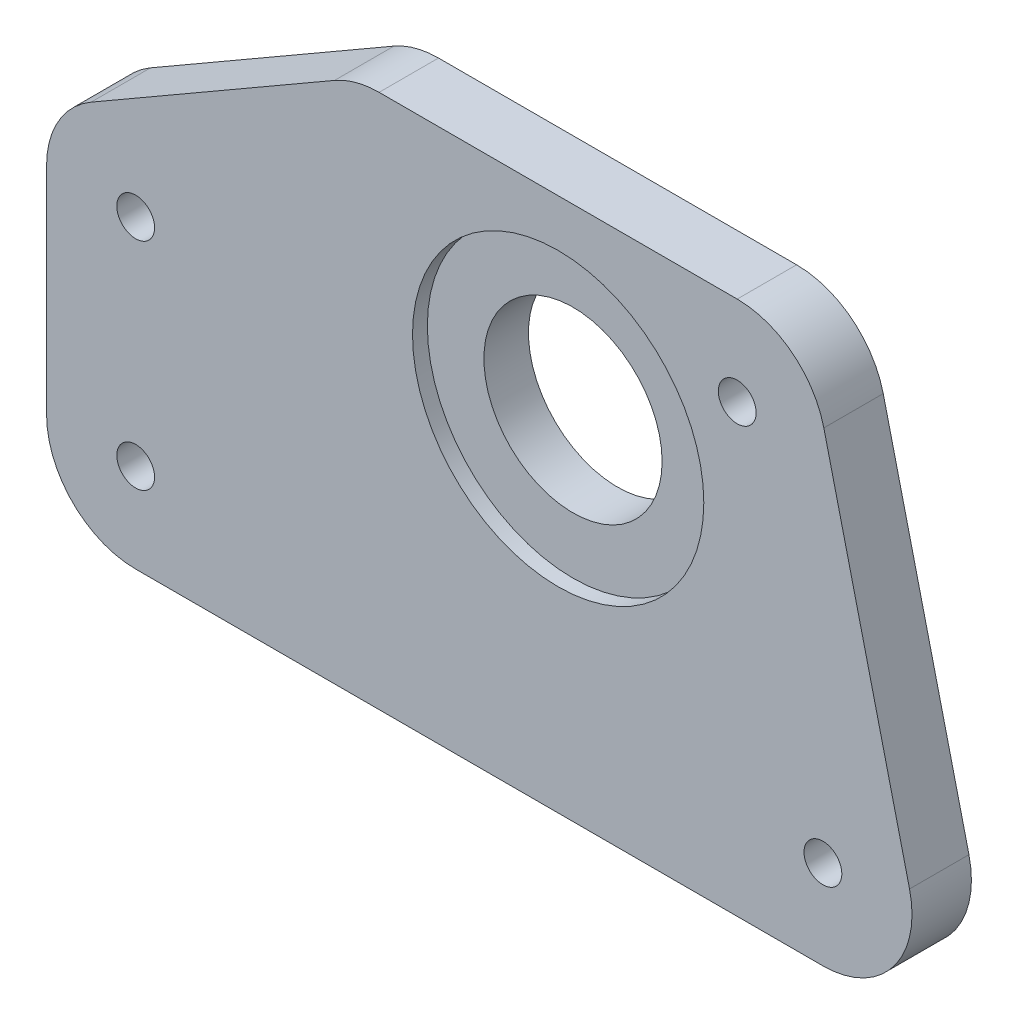
ISO-10303-21;
HEADER;
FILE_DESCRIPTION(('STEP AP214'),'2;1');
FILE_NAME('part.step','',(''),(''),'','','');
FILE_SCHEMA(('AUTOMOTIVE_DESIGN { 1 0 10303 214 1 1 1 1 }'));
ENDSEC;
DATA;
#1=APPLICATION_CONTEXT('core data for automotive mechanical design processes');
#2=APPLICATION_PROTOCOL_DEFINITION('international standard','automotive_design',2000,#1);
#3=PRODUCT_CONTEXT('',#1,'mechanical');
#4=PRODUCT('Part','Part','',(#3));
#5=PRODUCT_RELATED_PRODUCT_CATEGORY('part','',(#4));
#6=PRODUCT_DEFINITION_FORMATION('','',#4);
#7=PRODUCT_DEFINITION_CONTEXT('part definition',#1,'design');
#8=PRODUCT_DEFINITION('design','',#6,#7);
#9=PRODUCT_DEFINITION_SHAPE('','',#8);
#10=(LENGTH_UNIT() NAMED_UNIT(*) SI_UNIT(.MILLI.,.METRE.));
#11=(NAMED_UNIT(*) PLANE_ANGLE_UNIT() SI_UNIT($,.RADIAN.));
#12=(NAMED_UNIT(*) SI_UNIT($,.STERADIAN.) SOLID_ANGLE_UNIT());
#13=UNCERTAINTY_MEASURE_WITH_UNIT(LENGTH_MEASURE(1.E-05),#10,'distance_accuracy_value','');
#14=(GEOMETRIC_REPRESENTATION_CONTEXT(3) GLOBAL_UNCERTAINTY_ASSIGNED_CONTEXT((#13)) GLOBAL_UNIT_ASSIGNED_CONTEXT((#10,
#11,#12)) REPRESENTATION_CONTEXT('',''));
#15=CARTESIAN_POINT('',(0.,0.,0.));
#16=DIRECTION('',(0.,0.,1.));
#17=DIRECTION('',(1.,0.,0.));
#18=AXIS2_PLACEMENT_3D('',#15,#16,#17);
#19=CARTESIAN_POINT('',(0.,0.,6.35));
#20=DIRECTION('',(0.,0.,-1.));
#21=DIRECTION('',(-1.,0.,0.));
#22=AXIS2_PLACEMENT_3D('',#19,#20,#21);
#23=CYLINDRICAL_SURFACE('',#22,9.525);
#24=CARTESIAN_POINT('',(0.,0.,0.));
#25=DIRECTION('',(0.,0.,1.));
#26=DIRECTION('',(1.,0.,0.));
#27=AXIS2_PLACEMENT_3D('',#24,#25,#26);
#28=CIRCLE('',#27,9.525);
#29=CARTESIAN_POINT('',(9.525,0.,0.));
#30=VERTEX_POINT('',#29);
#31=EDGE_CURVE('E143',#30,#30,#28,.T.);
#32=ORIENTED_EDGE('',*,*,#31,.F.);
#33=EDGE_LOOP('',(#32));
#34=FACE_BOUND('',#33,.T.);
#35=CARTESIAN_POINT('',(0.,0.,4.7625));
#36=DIRECTION('',(0.,0.,1.));
#37=DIRECTION('',(1.,0.,0.));
#38=AXIS2_PLACEMENT_3D('',#35,#36,#37);
#39=CIRCLE('',#38,9.525);
#40=CARTESIAN_POINT('',(9.525,0.,4.7625));
#41=VERTEX_POINT('',#40);
#42=EDGE_CURVE('E36',#41,#41,#39,.T.);
#43=ORIENTED_EDGE('',*,*,#42,.T.);
#44=EDGE_LOOP('',(#43));
#45=FACE_BOUND('',#44,.T.);
#46=ADVANCED_FACE('F33',(#34,#45),#23,.F.);
#47=CARTESIAN_POINT('',(0.,-36.5125,6.35));
#48=DIRECTION('',(0.,1.,0.));
#49=DIRECTION('',(0.,0.,1.));
#50=AXIS2_PLACEMENT_3D('',#47,#48,#49);
#51=PLANE('',#50);
#52=DIRECTION('',(1.,0.,0.));
#53=VECTOR('',#52,1.);
#54=CARTESIAN_POINT('',(0.,-36.5125,0.));
#55=LINE('',#54,#53);
#56=CARTESIAN_POINT('',(-45.1626171174491,-36.5125,0.));
#57=VERTEX_POINT('',#56);
#58=CARTESIAN_POINT('',(28.303378868006,-36.5125,0.));
#59=VERTEX_POINT('',#58);
#60=EDGE_CURVE('E146',#57,#59,#55,.T.);
#61=ORIENTED_EDGE('',*,*,#60,.T.);
#62=DIRECTION('',(0.,0.,-1.));
#63=VECTOR('',#62,1.);
#64=CARTESIAN_POINT('',(28.303378868006,-36.5125,6.35));
#65=LINE('',#64,#63);
#66=CARTESIAN_POINT('',(28.303378868006,-36.5125,6.35));
#67=VERTEX_POINT('',#66);
#68=EDGE_CURVE('E11',#67,#59,#65,.T.);
#69=ORIENTED_EDGE('',*,*,#68,.F.);
#70=DIRECTION('',(1.,0.,0.));
#71=VECTOR('',#70,1.);
#72=CARTESIAN_POINT('',(0.,-36.5125,6.35));
#73=LINE('',#72,#71);
#74=CARTESIAN_POINT('',(-45.1626171174491,-36.5125,6.35));
#75=VERTEX_POINT('',#74);
#76=EDGE_CURVE('E170',#75,#67,#73,.T.);
#77=ORIENTED_EDGE('',*,*,#76,.F.);
#78=DIRECTION('',(0.,0.,-1.));
#79=VECTOR('',#78,1.);
#80=CARTESIAN_POINT('',(-45.1626171174491,-36.5125,6.35));
#81=LINE('',#80,#79);
#82=EDGE_CURVE('E142',#75,#57,#81,.T.);
#83=ORIENTED_EDGE('',*,*,#82,.T.);
#84=EDGE_LOOP('',(#61,#69,#77,#83));
#85=FACE_BOUND('',#84,.T.);
#86=ADVANCED_FACE('F217',(#85),#51,.F.);
#87=CARTESIAN_POINT('',(28.303378868006,-26.9875,6.35));
#88=DIRECTION('',(0.,0.,-1.));
#89=DIRECTION('',(-1.,0.,0.));
#90=AXIS2_PLACEMENT_3D('',#87,#88,#89);
#91=CYLINDRICAL_SURFACE('',#90,9.52499999999998);
#92=CARTESIAN_POINT('',(28.303378868006,-26.9875,0.));
#93=DIRECTION('',(0.,0.,1.));
#94=DIRECTION('',(1.,0.,0.));
#95=AXIS2_PLACEMENT_3D('',#92,#93,#94);
#96=CIRCLE('',#95,9.52499999999998);
#97=CARTESIAN_POINT('',(37.5642887039194,-24.760130697194,0.));
#98=VERTEX_POINT('',#97);
#99=EDGE_CURVE('E149',#59,#98,#96,.T.);
#100=ORIENTED_EDGE('',*,*,#99,.T.);
#101=DIRECTION('',(0.,0.,-1.));
#102=VECTOR('',#101,1.);
#103=CARTESIAN_POINT('',(37.5642887039194,-24.760130697194,6.35));
#104=LINE('',#103,#102);
#105=CARTESIAN_POINT('',(37.5642887039194,-24.760130697194,6.35));
#106=VERTEX_POINT('',#105);
#107=EDGE_CURVE('E42',#106,#98,#104,.T.);
#108=ORIENTED_EDGE('',*,*,#107,.F.);
#109=CARTESIAN_POINT('',(28.303378868006,-26.9875,6.35));
#110=DIRECTION('',(0.,0.,1.));
#111=DIRECTION('',(1.,0.,0.));
#112=AXIS2_PLACEMENT_3D('',#109,#110,#111);
#113=CIRCLE('',#112,9.52499999999998);
#114=EDGE_CURVE('E98',#67,#106,#113,.T.);
#115=ORIENTED_EDGE('',*,*,#114,.F.);
#116=ORIENTED_EDGE('',*,*,#68,.T.);
#117=EDGE_LOOP('',(#100,#108,#115,#116));
#118=FACE_BOUND('',#117,.T.);
#119=ADVANCED_FACE('F188',(#118),#91,.T.);
#120=CARTESIAN_POINT('',(29.8806631127974,7.18668823519191,6.35));
#121=DIRECTION('',(0.972273998521092,0.233844546226349,0.));
#122=DIRECTION('',(-0.233844546226349,0.972273998521092,0.));
#123=AXIS2_PLACEMENT_3D('',#120,#121,#122);
#124=PLANE('',#123);
#125=DIRECTION('',(0.233844546226349,-0.972273998521092,0.));
#126=VECTOR('',#125,1.);
#127=CARTESIAN_POINT('',(29.8806631127974,7.18668823519191,0.));
#128=LINE('',#127,#126);
#129=CARTESIAN_POINT('',(28.400743011269,13.339869302806,0.));
#130=VERTEX_POINT('',#129);
#131=EDGE_CURVE('E152',#130,#98,#128,.T.);
#132=ORIENTED_EDGE('',*,*,#131,.F.);
#133=DIRECTION('',(0.,0.,-1.));
#134=VECTOR('',#133,1.);
#135=CARTESIAN_POINT('',(28.400743011269,13.339869302806,6.35));
#136=LINE('',#135,#134);
#137=CARTESIAN_POINT('',(28.400743011269,13.339869302806,6.35));
#138=VERTEX_POINT('',#137);
#139=EDGE_CURVE('E180',#138,#130,#136,.T.);
#140=ORIENTED_EDGE('',*,*,#139,.F.);
#141=DIRECTION('',(0.233844546226349,-0.972273998521092,0.));
#142=VECTOR('',#141,1.);
#143=CARTESIAN_POINT('',(29.8806631127974,7.18668823519191,6.35));
#144=LINE('',#143,#142);
#145=EDGE_CURVE('E187',#138,#106,#144,.T.);
#146=ORIENTED_EDGE('',*,*,#145,.T.);
#147=ORIENTED_EDGE('',*,*,#107,.T.);
#148=EDGE_LOOP('',(#132,#140,#146,#147));
#149=FACE_BOUND('',#148,.T.);
#150=ADVANCED_FACE('F185',(#149),#124,.T.);
#151=CARTESIAN_POINT('',(19.1398331753556,11.1125,6.35));
#152=DIRECTION('',(0.,0.,-1.));
#153=DIRECTION('',(-1.,0.,0.));
#154=AXIS2_PLACEMENT_3D('',#151,#152,#153);
#155=CYLINDRICAL_SURFACE('',#154,9.525);
#156=CARTESIAN_POINT('',(19.1398331753556,11.1125,0.));
#157=DIRECTION('',(0.,0.,1.));
#158=DIRECTION('',(1.,0.,0.));
#159=AXIS2_PLACEMENT_3D('',#156,#157,#158);
#160=CIRCLE('',#159,9.525);
#161=CARTESIAN_POINT('',(19.1398331753556,20.6375,0.));
#162=VERTEX_POINT('',#161);
#163=EDGE_CURVE('E155',#130,#162,#160,.T.);
#164=ORIENTED_EDGE('',*,*,#163,.T.);
#165=DIRECTION('',(0.,0.,-1.));
#166=VECTOR('',#165,1.);
#167=CARTESIAN_POINT('',(19.1398331753556,20.6375,6.35));
#168=LINE('',#167,#166);
#169=CARTESIAN_POINT('',(19.1398331753556,20.6375,6.35));
#170=VERTEX_POINT('',#169);
#171=EDGE_CURVE('E178',#170,#162,#168,.T.);
#172=ORIENTED_EDGE('',*,*,#171,.F.);
#173=CARTESIAN_POINT('',(19.1398331753556,11.1125,6.35));
#174=DIRECTION('',(0.,0.,1.));
#175=DIRECTION('',(1.,0.,0.));
#176=AXIS2_PLACEMENT_3D('',#173,#174,#175);
#177=CIRCLE('',#176,9.525);
#178=EDGE_CURVE('E201',#138,#170,#177,.T.);
#179=ORIENTED_EDGE('',*,*,#178,.F.);
#180=ORIENTED_EDGE('',*,*,#139,.T.);
#181=EDGE_LOOP('',(#164,#172,#179,#180));
#182=FACE_BOUND('',#181,.T.);
#183=ADVANCED_FACE('F198',(#182),#155,.T.);
#184=CARTESIAN_POINT('',(0.,20.6375,6.35));
#185=DIRECTION('',(0.,1.,0.));
#186=DIRECTION('',(-1.,0.,0.));
#187=AXIS2_PLACEMENT_3D('',#184,#185,#186);
#188=PLANE('',#187);
#189=DIRECTION('',(1.,0.,0.));
#190=VECTOR('',#189,1.);
#191=CARTESIAN_POINT('',(0.,20.6375,0.));
#192=LINE('',#191,#190);
#193=CARTESIAN_POINT('',(-19.1398331753556,20.6375,0.));
#194=VERTEX_POINT('',#193);
#195=EDGE_CURVE('E158',#194,#162,#192,.T.);
#196=ORIENTED_EDGE('',*,*,#195,.F.);
#197=DIRECTION('',(0.,0.,-1.));
#198=VECTOR('',#197,1.);
#199=CARTESIAN_POINT('',(-19.1398331753556,20.6375,6.35));
#200=LINE('',#199,#198);
#201=CARTESIAN_POINT('',(-19.1398331753556,20.6375,6.35));
#202=VERTEX_POINT('',#201);
#203=EDGE_CURVE('E176',#202,#194,#200,.T.);
#204=ORIENTED_EDGE('',*,*,#203,.F.);
#205=DIRECTION('',(1.,0.,0.));
#206=VECTOR('',#205,1.);
#207=CARTESIAN_POINT('',(0.,20.6375,6.35));
#208=LINE('',#207,#206);
#209=EDGE_CURVE('E203',#202,#170,#208,.T.);
#210=ORIENTED_EDGE('',*,*,#209,.T.);
#211=ORIENTED_EDGE('',*,*,#171,.T.);
#212=EDGE_LOOP('',(#196,#204,#210,#211));
#213=FACE_BOUND('',#212,.T.);
#214=ADVANCED_FACE('F400',(#213),#188,.T.);
#215=CARTESIAN_POINT('',(-19.1398331753556,11.1125,6.35));
#216=DIRECTION('',(0.,0.,-1.));
#217=DIRECTION('',(-1.,0.,0.));
#218=AXIS2_PLACEMENT_3D('',#215,#216,#217);
#219=CYLINDRICAL_SURFACE('',#218,9.525);
#220=CARTESIAN_POINT('',(-19.1398331753556,11.1125,0.));
#221=DIRECTION('',(0.,0.,1.));
#222=DIRECTION('',(1.,0.,0.));
#223=AXIS2_PLACEMENT_3D('',#220,#221,#222);
#224=CIRCLE('',#223,9.525);
#225=CARTESIAN_POINT('',(-23.9023331753556,19.3613919710468,0.));
#226=VERTEX_POINT('',#225);
#227=EDGE_CURVE('E161',#194,#226,#224,.T.);
#228=ORIENTED_EDGE('',*,*,#227,.T.);
#229=DIRECTION('',(0.,0.,-1.));
#230=VECTOR('',#229,1.);
#231=CARTESIAN_POINT('',(-23.9023331753556,19.3613919710468,6.35));
#232=LINE('',#231,#230);
#233=CARTESIAN_POINT('',(-23.9023331753556,19.3613919710468,6.35));
#234=VERTEX_POINT('',#233);
#235=EDGE_CURVE('E174',#234,#226,#232,.T.);
#236=ORIENTED_EDGE('',*,*,#235,.F.);
#237=CARTESIAN_POINT('',(-19.1398331753556,11.1125,6.35));
#238=DIRECTION('',(0.,0.,1.));
#239=DIRECTION('',(1.,0.,0.));
#240=AXIS2_PLACEMENT_3D('',#237,#238,#239);
#241=CIRCLE('',#240,9.525);
#242=EDGE_CURVE('E137',#202,#234,#241,.T.);
#243=ORIENTED_EDGE('',*,*,#242,.F.);
#244=ORIENTED_EDGE('',*,*,#203,.T.);
#245=EDGE_LOOP('',(#228,#236,#243,#244));
#246=FACE_BOUND('',#245,.T.);
#247=ADVANCED_FACE('F212',(#246),#219,.T.);
#248=CARTESIAN_POINT('',(-14.3593119436163,24.8710578480739,6.35));
#249=DIRECTION('',(-0.500000000000002,0.866025403784438,0.));
#250=DIRECTION('',(-0.866025403784438,-0.500000000000002,0.));
#251=AXIS2_PLACEMENT_3D('',#248,#249,#250);
#252=PLANE('',#251);
#253=DIRECTION('',(0.866025403784438,0.500000000000002,0.));
#254=VECTOR('',#253,1.);
#255=CARTESIAN_POINT('',(-14.3593119436163,24.8710578480739,0.));
#256=LINE('',#255,#254);
#257=CARTESIAN_POINT('',(-49.9251171174491,4.33713065701561,0.));
#258=VERTEX_POINT('',#257);
#259=EDGE_CURVE('E164',#258,#226,#256,.T.);
#260=ORIENTED_EDGE('',*,*,#259,.F.);
#261=DIRECTION('',(0.,0.,-1.));
#262=VECTOR('',#261,1.);
#263=CARTESIAN_POINT('',(-49.9251171174491,4.33713065701561,6.35));
#264=LINE('',#263,#262);
#265=CARTESIAN_POINT('',(-49.9251171174491,4.33713065701561,6.35));
#266=VERTEX_POINT('',#265);
#267=EDGE_CURVE('E126',#266,#258,#264,.T.);
#268=ORIENTED_EDGE('',*,*,#267,.F.);
#269=DIRECTION('',(0.866025403784438,0.500000000000002,0.));
#270=VECTOR('',#269,1.);
#271=CARTESIAN_POINT('',(-14.3593119436163,24.8710578480739,6.35));
#272=LINE('',#271,#270);
#273=EDGE_CURVE('E135',#266,#234,#272,.T.);
#274=ORIENTED_EDGE('',*,*,#273,.T.);
#275=ORIENTED_EDGE('',*,*,#235,.T.);
#276=EDGE_LOOP('',(#260,#268,#274,#275));
#277=FACE_BOUND('',#276,.T.);
#278=ADVANCED_FACE('F215',(#277),#252,.T.);
#279=CARTESIAN_POINT('',(-45.1626171174491,-3.91176131403116,6.35));
#280=DIRECTION('',(0.,0.,-1.));
#281=DIRECTION('',(-1.,0.,0.));
#282=AXIS2_PLACEMENT_3D('',#279,#280,#281);
#283=CYLINDRICAL_SURFACE('',#282,9.525);
#284=CARTESIAN_POINT('',(-45.1626171174491,-3.91176131403116,0.));
#285=DIRECTION('',(0.,0.,1.));
#286=DIRECTION('',(1.,0.,0.));
#287=AXIS2_PLACEMENT_3D('',#284,#285,#286);
#288=CIRCLE('',#287,9.525);
#289=CARTESIAN_POINT('',(-54.6876171174491,-3.91176131403116,0.));
#290=VERTEX_POINT('',#289);
#291=EDGE_CURVE('E125',#290,#258,#288,.F.);
#292=ORIENTED_EDGE('',*,*,#291,.F.);
#293=DIRECTION('',(0.,0.,-1.));
#294=VECTOR('',#293,1.);
#295=CARTESIAN_POINT('',(-54.6876171174491,-3.91176131403116,6.35));
#296=LINE('',#295,#294);
#297=CARTESIAN_POINT('',(-54.6876171174491,-3.91176131403116,6.35));
#298=VERTEX_POINT('',#297);
#299=EDGE_CURVE('E119',#298,#290,#296,.T.);
#300=ORIENTED_EDGE('',*,*,#299,.F.);
#301=CARTESIAN_POINT('',(-45.1626171174491,-3.91176131403116,6.35));
#302=DIRECTION('',(0.,0.,1.));
#303=DIRECTION('',(1.,0.,0.));
#304=AXIS2_PLACEMENT_3D('',#301,#302,#303);
#305=CIRCLE('',#304,9.525);
#306=EDGE_CURVE('E123',#298,#266,#305,.F.);
#307=ORIENTED_EDGE('',*,*,#306,.T.);
#308=ORIENTED_EDGE('',*,*,#267,.T.);
#309=EDGE_LOOP('',(#292,#300,#307,#308));
#310=FACE_BOUND('',#309,.T.);
#311=ADVANCED_FACE('F121',(#310),#283,.T.);
#312=CARTESIAN_POINT('',(-54.6876171174491,0.,6.35));
#313=DIRECTION('',(1.,0.,0.));
#314=DIRECTION('',(0.,0.,-1.));
#315=AXIS2_PLACEMENT_3D('',#312,#313,#314);
#316=PLANE('',#315);
#317=DIRECTION('',(0.,-1.,0.));
#318=VECTOR('',#317,1.);
#319=CARTESIAN_POINT('',(-54.6876171174491,0.,0.));
#320=LINE('',#319,#318);
#321=CARTESIAN_POINT('',(-54.6876171174491,-26.9875,0.));
#322=VERTEX_POINT('',#321);
#323=EDGE_CURVE('E84',#290,#322,#320,.T.);
#324=ORIENTED_EDGE('',*,*,#323,.T.);
#325=DIRECTION('',(0.,0.,-1.));
#326=VECTOR('',#325,1.);
#327=CARTESIAN_POINT('',(-54.6876171174491,-26.9875,6.35));
#328=LINE('',#327,#326);
#329=CARTESIAN_POINT('',(-54.6876171174491,-26.9875,6.35));
#330=VERTEX_POINT('',#329);
#331=EDGE_CURVE('E127',#330,#322,#328,.T.);
#332=ORIENTED_EDGE('',*,*,#331,.F.);
#333=DIRECTION('',(0.,-1.,0.));
#334=VECTOR('',#333,1.);
#335=CARTESIAN_POINT('',(-54.6876171174491,0.,6.35));
#336=LINE('',#335,#334);
#337=EDGE_CURVE('E129',#298,#330,#336,.T.);
#338=ORIENTED_EDGE('',*,*,#337,.F.);
#339=ORIENTED_EDGE('',*,*,#299,.T.);
#340=EDGE_LOOP('',(#324,#332,#338,#339));
#341=FACE_BOUND('',#340,.T.);
#342=ADVANCED_FACE('F130',(#341),#316,.F.);
#343=CARTESIAN_POINT('',(-45.1626171174491,-26.9875,6.35));
#344=DIRECTION('',(0.,0.,-1.));
#345=DIRECTION('',(-1.,0.,0.));
#346=AXIS2_PLACEMENT_3D('',#343,#344,#345);
#347=CYLINDRICAL_SURFACE('',#346,9.525);
#348=CARTESIAN_POINT('',(-45.1626171174491,-26.9875,0.));
#349=DIRECTION('',(0.,0.,1.));
#350=DIRECTION('',(1.,0.,0.));
#351=AXIS2_PLACEMENT_3D('',#348,#349,#350);
#352=CIRCLE('',#351,9.525);
#353=EDGE_CURVE('E90',#322,#57,#352,.T.);
#354=ORIENTED_EDGE('',*,*,#353,.T.);
#355=ORIENTED_EDGE('',*,*,#82,.F.);
#356=CARTESIAN_POINT('',(-45.1626171174491,-26.9875,6.35));
#357=DIRECTION('',(0.,0.,1.));
#358=DIRECTION('',(1.,0.,0.));
#359=AXIS2_PLACEMENT_3D('',#356,#357,#358);
#360=CIRCLE('',#359,9.525);
#361=EDGE_CURVE('E50',#330,#75,#360,.T.);
#362=ORIENTED_EDGE('',*,*,#361,.F.);
#363=ORIENTED_EDGE('',*,*,#331,.T.);
#364=EDGE_LOOP('',(#354,#355,#362,#363));
#365=FACE_BOUND('',#364,.T.);
#366=ADVANCED_FACE('F219',(#365),#347,.T.);
#367=CARTESIAN_POINT('',(0.,0.,6.35));
#368=DIRECTION('',(0.,0.,1.));
#369=DIRECTION('',(1.,0.,0.));
#370=AXIS2_PLACEMENT_3D('',#367,#368,#369);
#371=PLANE('',#370);
#372=CARTESIAN_POINT('',(28.303378868006,-26.9875,6.35));
#373=DIRECTION('',(0.,0.,-1.));
#374=DIRECTION('',(-1.,0.,0.));
#375=AXIS2_PLACEMENT_3D('',#372,#373,#374);
#376=CIRCLE('',#375,2.0193);
#377=CARTESIAN_POINT('',(26.284078868006,-26.9875,6.35));
#378=VERTEX_POINT('',#377);
#379=EDGE_CURVE('E269',#378,#378,#376,.T.);
#380=ORIENTED_EDGE('',*,*,#379,.T.);
#381=EDGE_LOOP('',(#380));
#382=FACE_BOUND('',#381,.T.);
#383=CARTESIAN_POINT('',(19.1398331753556,11.1125,6.35));
#384=DIRECTION('',(0.,0.,-1.));
#385=DIRECTION('',(-1.,0.,0.));
#386=AXIS2_PLACEMENT_3D('',#383,#384,#385);
#387=CIRCLE('',#386,2.0193);
#388=CARTESIAN_POINT('',(17.1205331753556,11.1125,6.35));
#389=VERTEX_POINT('',#388);
#390=EDGE_CURVE('E263',#389,#389,#387,.T.);
#391=ORIENTED_EDGE('',*,*,#390,.T.);
#392=EDGE_LOOP('',(#391));
#393=FACE_BOUND('',#392,.T.);
#394=CARTESIAN_POINT('',(-45.1626171174491,-3.91176131403116,6.35));
#395=DIRECTION('',(0.,0.,-1.));
#396=DIRECTION('',(-1.,0.,0.));
#397=AXIS2_PLACEMENT_3D('',#394,#395,#396);
#398=CIRCLE('',#397,2.0193);
#399=CARTESIAN_POINT('',(-47.1819171174491,-3.91176131403116,6.35));
#400=VERTEX_POINT('',#399);
#401=EDGE_CURVE('E257',#400,#400,#398,.T.);
#402=ORIENTED_EDGE('',*,*,#401,.T.);
#403=EDGE_LOOP('',(#402));
#404=FACE_BOUND('',#403,.T.);
#405=CARTESIAN_POINT('',(-45.1626171174491,-26.9875,6.35));
#406=DIRECTION('',(0.,0.,-1.));
#407=DIRECTION('',(-1.,0.,0.));
#408=AXIS2_PLACEMENT_3D('',#405,#406,#407);
#409=CIRCLE('',#408,2.0193);
#410=CARTESIAN_POINT('',(-47.1819171174491,-26.9875,6.35));
#411=VERTEX_POINT('',#410);
#412=EDGE_CURVE('E249',#411,#411,#409,.T.);
#413=ORIENTED_EDGE('',*,*,#412,.T.);
#414=EDGE_LOOP('',(#413));
#415=FACE_BOUND('',#414,.T.);
#416=CARTESIAN_POINT('',(0.,0.,6.35));
#417=DIRECTION('',(0.,0.,1.));
#418=DIRECTION('',(1.,0.,0.));
#419=AXIS2_PLACEMENT_3D('',#416,#417,#418);
#420=CIRCLE('',#419,15.5702);
#421=CARTESIAN_POINT('',(15.5702,0.,6.35));
#422=VERTEX_POINT('',#421);
#423=EDGE_CURVE('E244',#422,#422,#420,.T.);
#424=ORIENTED_EDGE('',*,*,#423,.F.);
#425=EDGE_LOOP('',(#424));
#426=FACE_BOUND('',#425,.T.);
#427=ORIENTED_EDGE('',*,*,#76,.T.);
#428=ORIENTED_EDGE('',*,*,#114,.T.);
#429=ORIENTED_EDGE('',*,*,#145,.F.);
#430=ORIENTED_EDGE('',*,*,#178,.T.);
#431=ORIENTED_EDGE('',*,*,#209,.F.);
#432=ORIENTED_EDGE('',*,*,#242,.T.);
#433=ORIENTED_EDGE('',*,*,#273,.F.);
#434=ORIENTED_EDGE('',*,*,#306,.F.);
#435=ORIENTED_EDGE('',*,*,#337,.T.);
#436=ORIENTED_EDGE('',*,*,#361,.T.);
#437=EDGE_LOOP('',(#427,#428,#429,#430,#431,#432,#433,#434,#435,#436));
#438=FACE_BOUND('',#437,.T.);
#439=ADVANCED_FACE('F133',(#382,#393,#404,#415,#426,#438),#371,.T.);
#440=CARTESIAN_POINT('',(0.,0.,0.));
#441=DIRECTION('',(0.,0.,1.));
#442=DIRECTION('',(1.,0.,0.));
#443=AXIS2_PLACEMENT_3D('',#440,#441,#442);
#444=PLANE('',#443);
#445=CARTESIAN_POINT('',(28.303378868006,-26.9875,0.));
#446=DIRECTION('',(0.,0.,-1.));
#447=DIRECTION('',(-1.,0.,0.));
#448=AXIS2_PLACEMENT_3D('',#445,#446,#447);
#449=CIRCLE('',#448,2.0193);
#450=CARTESIAN_POINT('',(26.284078868006,-26.9875,0.));
#451=VERTEX_POINT('',#450);
#452=EDGE_CURVE('E272',#451,#451,#449,.T.);
#453=ORIENTED_EDGE('',*,*,#452,.F.);
#454=EDGE_LOOP('',(#453));
#455=FACE_BOUND('',#454,.T.);
#456=CARTESIAN_POINT('',(19.1398331753556,11.1125,0.));
#457=DIRECTION('',(0.,0.,-1.));
#458=DIRECTION('',(-1.,0.,0.));
#459=AXIS2_PLACEMENT_3D('',#456,#457,#458);
#460=CIRCLE('',#459,2.0193);
#461=CARTESIAN_POINT('',(17.1205331753556,11.1125,0.));
#462=VERTEX_POINT('',#461);
#463=EDGE_CURVE('E266',#462,#462,#460,.T.);
#464=ORIENTED_EDGE('',*,*,#463,.F.);
#465=EDGE_LOOP('',(#464));
#466=FACE_BOUND('',#465,.T.);
#467=CARTESIAN_POINT('',(-45.1626171174491,-3.91176131403116,0.));
#468=DIRECTION('',(0.,0.,-1.));
#469=DIRECTION('',(-1.,0.,0.));
#470=AXIS2_PLACEMENT_3D('',#467,#468,#469);
#471=CIRCLE('',#470,2.0193);
#472=CARTESIAN_POINT('',(-47.1819171174491,-3.91176131403116,0.));
#473=VERTEX_POINT('',#472);
#474=EDGE_CURVE('E260',#473,#473,#471,.T.);
#475=ORIENTED_EDGE('',*,*,#474,.F.);
#476=EDGE_LOOP('',(#475));
#477=FACE_BOUND('',#476,.T.);
#478=CARTESIAN_POINT('',(-45.1626171174491,-26.9875,0.));
#479=DIRECTION('',(0.,0.,-1.));
#480=DIRECTION('',(-1.,0.,0.));
#481=AXIS2_PLACEMENT_3D('',#478,#479,#480);
#482=CIRCLE('',#481,2.0193);
#483=CARTESIAN_POINT('',(-47.1819171174491,-26.9875,0.));
#484=VERTEX_POINT('',#483);
#485=EDGE_CURVE('E254',#484,#484,#482,.T.);
#486=ORIENTED_EDGE('',*,*,#485,.F.);
#487=EDGE_LOOP('',(#486));
#488=FACE_BOUND('',#487,.T.);
#489=ORIENTED_EDGE('',*,*,#31,.T.);
#490=EDGE_LOOP('',(#489));
#491=FACE_BOUND('',#490,.T.);
#492=ORIENTED_EDGE('',*,*,#60,.F.);
#493=ORIENTED_EDGE('',*,*,#353,.F.);
#494=ORIENTED_EDGE('',*,*,#323,.F.);
#495=ORIENTED_EDGE('',*,*,#291,.T.);
#496=ORIENTED_EDGE('',*,*,#259,.T.);
#497=ORIENTED_EDGE('',*,*,#227,.F.);
#498=ORIENTED_EDGE('',*,*,#195,.T.);
#499=ORIENTED_EDGE('',*,*,#163,.F.);
#500=ORIENTED_EDGE('',*,*,#131,.T.);
#501=ORIENTED_EDGE('',*,*,#99,.F.);
#502=EDGE_LOOP('',(#492,#493,#494,#495,#496,#497,#498,#499,#500,#501));
#503=FACE_BOUND('',#502,.T.);
#504=ADVANCED_FACE('F193',(#455,#466,#477,#488,#491,#503),#444,.F.);
#505=CARTESIAN_POINT('',(0.,0.,4.7625));
#506=DIRECTION('',(0.,0.,1.));
#507=DIRECTION('',(1.,0.,0.));
#508=AXIS2_PLACEMENT_3D('',#505,#506,#507);
#509=CYLINDRICAL_SURFACE('',#508,15.5702);
#510=CARTESIAN_POINT('',(0.,0.,4.7625));
#511=DIRECTION('',(0.,0.,1.));
#512=DIRECTION('',(1.,0.,0.));
#513=AXIS2_PLACEMENT_3D('',#510,#511,#512);
#514=CIRCLE('',#513,15.5702);
#515=CARTESIAN_POINT('',(15.5702,0.,4.7625));
#516=VERTEX_POINT('',#515);
#517=EDGE_CURVE('E242',#516,#516,#514,.T.);
#518=ORIENTED_EDGE('',*,*,#517,.F.);
#519=EDGE_LOOP('',(#518));
#520=FACE_BOUND('',#519,.T.);
#521=ORIENTED_EDGE('',*,*,#423,.T.);
#522=EDGE_LOOP('',(#521));
#523=FACE_BOUND('',#522,.T.);
#524=ADVANCED_FACE('F280',(#520,#523),#509,.F.);
#525=CARTESIAN_POINT('',(0.,0.,4.7625));
#526=DIRECTION('',(0.,0.,1.));
#527=DIRECTION('',(1.,0.,0.));
#528=AXIS2_PLACEMENT_3D('',#525,#526,#527);
#529=PLANE('',#528);
#530=ORIENTED_EDGE('',*,*,#42,.F.);
#531=EDGE_LOOP('',(#530));
#532=FACE_BOUND('',#531,.T.);
#533=ORIENTED_EDGE('',*,*,#517,.T.);
#534=EDGE_LOOP('',(#533));
#535=FACE_BOUND('',#534,.T.);
#536=ADVANCED_FACE('F291',(#532,#535),#529,.T.);
#537=CARTESIAN_POINT('',(-45.1626171174491,-26.9875,0.));
#538=DIRECTION('',(0.,0.,-1.));
#539=DIRECTION('',(-1.,0.,0.));
#540=AXIS2_PLACEMENT_3D('',#537,#538,#539);
#541=CYLINDRICAL_SURFACE('',#540,2.0193);
#542=ORIENTED_EDGE('',*,*,#412,.F.);
#543=EDGE_LOOP('',(#542));
#544=FACE_BOUND('',#543,.T.);
#545=ORIENTED_EDGE('',*,*,#485,.T.);
#546=EDGE_LOOP('',(#545));
#547=FACE_BOUND('',#546,.T.);
#548=ADVANCED_FACE('F288',(#544,#547),#541,.F.);
#549=CARTESIAN_POINT('',(-45.1626171174491,-3.91176131403116,0.));
#550=DIRECTION('',(0.,0.,-1.));
#551=DIRECTION('',(-1.,0.,0.));
#552=AXIS2_PLACEMENT_3D('',#549,#550,#551);
#553=CYLINDRICAL_SURFACE('',#552,2.0193);
#554=ORIENTED_EDGE('',*,*,#401,.F.);
#555=EDGE_LOOP('',(#554));
#556=FACE_BOUND('',#555,.T.);
#557=ORIENTED_EDGE('',*,*,#474,.T.);
#558=EDGE_LOOP('',(#557));
#559=FACE_BOUND('',#558,.T.);
#560=ADVANCED_FACE('F290',(#556,#559),#553,.F.);
#561=CARTESIAN_POINT('',(19.1398331753556,11.1125,0.));
#562=DIRECTION('',(0.,0.,-1.));
#563=DIRECTION('',(-1.,0.,0.));
#564=AXIS2_PLACEMENT_3D('',#561,#562,#563);
#565=CYLINDRICAL_SURFACE('',#564,2.0193);
#566=ORIENTED_EDGE('',*,*,#390,.F.);
#567=EDGE_LOOP('',(#566));
#568=FACE_BOUND('',#567,.T.);
#569=ORIENTED_EDGE('',*,*,#463,.T.);
#570=EDGE_LOOP('',(#569));
#571=FACE_BOUND('',#570,.T.);
#572=ADVANCED_FACE('F298',(#568,#571),#565,.F.);
#573=CARTESIAN_POINT('',(28.303378868006,-26.9875,0.));
#574=DIRECTION('',(0.,0.,-1.));
#575=DIRECTION('',(-1.,0.,0.));
#576=AXIS2_PLACEMENT_3D('',#573,#574,#575);
#577=CYLINDRICAL_SURFACE('',#576,2.0193);
#578=ORIENTED_EDGE('',*,*,#379,.F.);
#579=EDGE_LOOP('',(#578));
#580=FACE_BOUND('',#579,.T.);
#581=ORIENTED_EDGE('',*,*,#452,.T.);
#582=EDGE_LOOP('',(#581));
#583=FACE_BOUND('',#582,.T.);
#584=ADVANCED_FACE('F276',(#580,#583),#577,.F.);
#585=CLOSED_SHELL('',(#46,#86,#119,#150,#183,#214,#247,#278,#311,#342,#366,#439,#504,#524,#536,
#548,#560,#572,#584));
#586=MANIFOLD_SOLID_BREP('B2',#585);
#587=ADVANCED_BREP_SHAPE_REPRESENTATION('',(#18,#586),#14);
#588=SHAPE_DEFINITION_REPRESENTATION(#9,#587);
ENDSEC;
END-ISO-10303-21;
